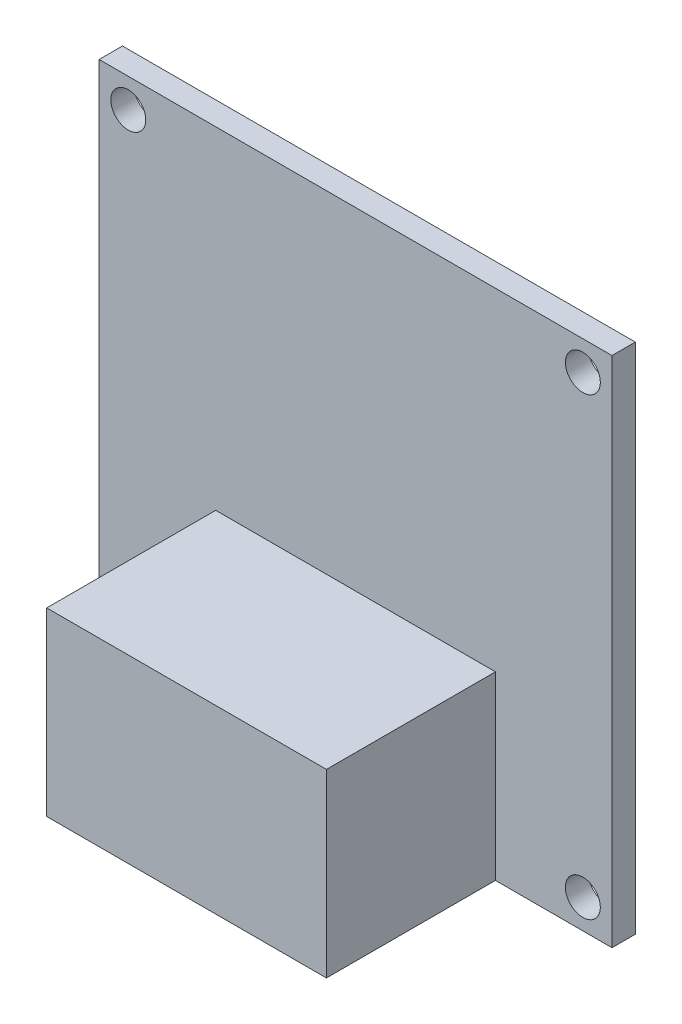
ISO-10303-21;
HEADER;
FILE_DESCRIPTION(('STEP AP214'),'2;1');
FILE_NAME('part.step','',(''),(''),'','','');
FILE_SCHEMA(('AUTOMOTIVE_DESIGN { 1 0 10303 214 1 1 1 1 }'));
ENDSEC;
DATA;
#1=APPLICATION_CONTEXT('core data for automotive mechanical design processes');
#2=APPLICATION_PROTOCOL_DEFINITION('international standard','automotive_design',2000,#1);
#3=PRODUCT_CONTEXT('',#1,'mechanical');
#4=PRODUCT('Part','Part','',(#3));
#5=PRODUCT_RELATED_PRODUCT_CATEGORY('part','',(#4));
#6=PRODUCT_DEFINITION_FORMATION('','',#4);
#7=PRODUCT_DEFINITION_CONTEXT('part definition',#1,'design');
#8=PRODUCT_DEFINITION('design','',#6,#7);
#9=PRODUCT_DEFINITION_SHAPE('','',#8);
#10=(LENGTH_UNIT() NAMED_UNIT(*) SI_UNIT(.MILLI.,.METRE.));
#11=(NAMED_UNIT(*) PLANE_ANGLE_UNIT() SI_UNIT($,.RADIAN.));
#12=(NAMED_UNIT(*) SI_UNIT($,.STERADIAN.) SOLID_ANGLE_UNIT());
#13=UNCERTAINTY_MEASURE_WITH_UNIT(LENGTH_MEASURE(1.E-05),#10,'distance_accuracy_value','');
#14=(GEOMETRIC_REPRESENTATION_CONTEXT(3) GLOBAL_UNCERTAINTY_ASSIGNED_CONTEXT((#13)) GLOBAL_UNIT_ASSIGNED_CONTEXT((#10,
#11,#12)) REPRESENTATION_CONTEXT('',''));
#15=CARTESIAN_POINT('',(0.,0.,0.));
#16=DIRECTION('',(0.,0.,1.));
#17=DIRECTION('',(1.,0.,0.));
#18=AXIS2_PLACEMENT_3D('',#15,#16,#17);
#19=CARTESIAN_POINT('',(12.,-22.,16.5));
#20=DIRECTION('',(0.,1.,0.));
#21=DIRECTION('',(0.,0.,1.));
#22=AXIS2_PLACEMENT_3D('',#19,#20,#21);
#23=PLANE('',#22);
#24=DIRECTION('',(1.,0.,0.));
#25=VECTOR('',#24,1.);
#26=CARTESIAN_POINT('',(12.,-22.,2.));
#27=LINE('',#26,#25);
#28=CARTESIAN_POINT('',(-12.,-22.,2.));
#29=VERTEX_POINT('',#28);
#30=CARTESIAN_POINT('',(12.,-22.,2.));
#31=VERTEX_POINT('',#30);
#32=EDGE_CURVE('E106',#29,#31,#27,.T.);
#33=ORIENTED_EDGE('',*,*,#32,.T.);
#34=DIRECTION('',(0.,0.,-1.));
#35=VECTOR('',#34,1.);
#36=CARTESIAN_POINT('',(12.,-22.,16.5));
#37=LINE('',#36,#35);
#38=CARTESIAN_POINT('',(12.,-22.,16.5));
#39=VERTEX_POINT('',#38);
#40=EDGE_CURVE('E12',#39,#31,#37,.T.);
#41=ORIENTED_EDGE('',*,*,#40,.F.);
#42=DIRECTION('',(1.,0.,0.));
#43=VECTOR('',#42,1.);
#44=CARTESIAN_POINT('',(12.,-22.,16.5));
#45=LINE('',#44,#43);
#46=CARTESIAN_POINT('',(-12.,-22.,16.5));
#47=VERTEX_POINT('',#46);
#48=EDGE_CURVE('E94',#47,#39,#45,.T.);
#49=ORIENTED_EDGE('',*,*,#48,.F.);
#50=DIRECTION('',(0.,0.,-1.));
#51=VECTOR('',#50,1.);
#52=CARTESIAN_POINT('',(-12.,-22.,16.5));
#53=LINE('',#52,#51);
#54=EDGE_CURVE('E102',#47,#29,#53,.T.);
#55=ORIENTED_EDGE('',*,*,#54,.T.);
#56=EDGE_LOOP('',(#33,#41,#49,#55));
#57=FACE_BOUND('',#56,.T.);
#58=ADVANCED_FACE('F43',(#57),#23,.F.);
#59=CARTESIAN_POINT('',(12.,-22.,16.5));
#60=DIRECTION('',(-1.,0.,0.));
#61=DIRECTION('',(0.,-1.,0.));
#62=AXIS2_PLACEMENT_3D('',#59,#60,#61);
#63=PLANE('',#62);
#64=DIRECTION('',(0.,1.,0.));
#65=VECTOR('',#64,1.);
#66=CARTESIAN_POINT('',(12.,-22.,2.));
#67=LINE('',#66,#65);
#68=CARTESIAN_POINT('',(12.,-6.50000000000001,2.));
#69=VERTEX_POINT('',#68);
#70=EDGE_CURVE('E98',#31,#69,#67,.T.);
#71=ORIENTED_EDGE('',*,*,#70,.T.);
#72=DIRECTION('',(0.,0.,-1.));
#73=VECTOR('',#72,1.);
#74=CARTESIAN_POINT('',(12.,-6.50000000000001,16.5));
#75=LINE('',#74,#73);
#76=CARTESIAN_POINT('',(12.,-6.50000000000001,16.5));
#77=VERTEX_POINT('',#76);
#78=EDGE_CURVE('E51',#77,#69,#75,.T.);
#79=ORIENTED_EDGE('',*,*,#78,.F.);
#80=DIRECTION('',(0.,1.,0.));
#81=VECTOR('',#80,1.);
#82=CARTESIAN_POINT('',(12.,-22.,16.5));
#83=LINE('',#82,#81);
#84=EDGE_CURVE('E89',#39,#77,#83,.T.);
#85=ORIENTED_EDGE('',*,*,#84,.F.);
#86=ORIENTED_EDGE('',*,*,#40,.T.);
#87=EDGE_LOOP('',(#71,#79,#85,#86));
#88=FACE_BOUND('',#87,.T.);
#89=ADVANCED_FACE('F97',(#88),#63,.F.);
#90=CARTESIAN_POINT('',(12.,-6.50000000000001,16.5));
#91=DIRECTION('',(0.,-1.,0.));
#92=DIRECTION('',(1.,0.,0.));
#93=AXIS2_PLACEMENT_3D('',#90,#91,#92);
#94=PLANE('',#93);
#95=DIRECTION('',(-1.,0.,0.));
#96=VECTOR('',#95,1.);
#97=CARTESIAN_POINT('',(12.,-6.50000000000001,2.));
#98=LINE('',#97,#96);
#99=CARTESIAN_POINT('',(-12.,-6.50000000000001,2.));
#100=VERTEX_POINT('',#99);
#101=EDGE_CURVE('E76',#69,#100,#98,.T.);
#102=ORIENTED_EDGE('',*,*,#101,.T.);
#103=DIRECTION('',(0.,0.,-1.));
#104=VECTOR('',#103,1.);
#105=CARTESIAN_POINT('',(-12.,-6.50000000000001,16.5));
#106=LINE('',#105,#104);
#107=CARTESIAN_POINT('',(-12.,-6.50000000000001,16.5));
#108=VERTEX_POINT('',#107);
#109=EDGE_CURVE('E99',#108,#100,#106,.T.);
#110=ORIENTED_EDGE('',*,*,#109,.F.);
#111=DIRECTION('',(-1.,0.,0.));
#112=VECTOR('',#111,1.);
#113=CARTESIAN_POINT('',(12.,-6.50000000000001,16.5));
#114=LINE('',#113,#112);
#115=EDGE_CURVE('E92',#77,#108,#114,.T.);
#116=ORIENTED_EDGE('',*,*,#115,.F.);
#117=ORIENTED_EDGE('',*,*,#78,.T.);
#118=EDGE_LOOP('',(#102,#110,#116,#117));
#119=FACE_BOUND('',#118,.T.);
#120=ADVANCED_FACE('F100',(#119),#94,.F.);
#121=CARTESIAN_POINT('',(-12.,-6.50000000000001,16.5));
#122=DIRECTION('',(1.,0.,0.));
#123=DIRECTION('',(0.,1.,0.));
#124=AXIS2_PLACEMENT_3D('',#121,#122,#123);
#125=PLANE('',#124);
#126=DIRECTION('',(0.,-1.,0.));
#127=VECTOR('',#126,1.);
#128=CARTESIAN_POINT('',(-12.,-6.50000000000001,2.));
#129=LINE('',#128,#127);
#130=EDGE_CURVE('E82',#100,#29,#129,.T.);
#131=ORIENTED_EDGE('',*,*,#130,.T.);
#132=ORIENTED_EDGE('',*,*,#54,.F.);
#133=DIRECTION('',(0.,-1.,0.));
#134=VECTOR('',#133,1.);
#135=CARTESIAN_POINT('',(-12.,-6.50000000000001,16.5));
#136=LINE('',#135,#134);
#137=EDGE_CURVE('E59',#108,#47,#136,.T.);
#138=ORIENTED_EDGE('',*,*,#137,.F.);
#139=ORIENTED_EDGE('',*,*,#109,.T.);
#140=EDGE_LOOP('',(#131,#132,#138,#139));
#141=FACE_BOUND('',#140,.T.);
#142=ADVANCED_FACE('F113',(#141),#125,.F.);
#143=CARTESIAN_POINT('',(0.,0.,16.5));
#144=DIRECTION('',(0.,0.,1.));
#145=DIRECTION('',(1.,0.,0.));
#146=AXIS2_PLACEMENT_3D('',#143,#144,#145);
#147=PLANE('',#146);
#148=ORIENTED_EDGE('',*,*,#48,.T.);
#149=ORIENTED_EDGE('',*,*,#84,.T.);
#150=ORIENTED_EDGE('',*,*,#115,.T.);
#151=ORIENTED_EDGE('',*,*,#137,.T.);
#152=EDGE_LOOP('',(#148,#149,#150,#151));
#153=FACE_BOUND('',#152,.T.);
#154=ADVANCED_FACE('F90',(#153),#147,.T.);
#155=CARTESIAN_POINT('',(0.,0.,2.));
#156=DIRECTION('',(0.,0.,1.));
#157=DIRECTION('',(1.,0.,0.));
#158=AXIS2_PLACEMENT_3D('',#155,#156,#157);
#159=PLANE('',#158);
#160=ORIENTED_EDGE('',*,*,#32,.F.);
#161=ORIENTED_EDGE('',*,*,#130,.F.);
#162=ORIENTED_EDGE('',*,*,#101,.F.);
#163=ORIENTED_EDGE('',*,*,#70,.F.);
#164=EDGE_LOOP('',(#160,#161,#162,#163));
#165=FACE_BOUND('',#164,.T.);
#166=ADVANCED_FACE('F116',(#165),#159,.F.);
#167=CLOSED_SHELL('',(#58,#89,#120,#142,#154,#166));
#168=MANIFOLD_SOLID_BREP('B2',#167);
#169=CARTESIAN_POINT('',(0.,0.,2.));
#170=DIRECTION('',(0.,0.,1.));
#171=DIRECTION('',(1.,0.,0.));
#172=AXIS2_PLACEMENT_3D('',#169,#170,#171);
#173=PLANE('',#172);
#174=CARTESIAN_POINT('',(-19.5,-19.5,2.));
#175=DIRECTION('',(0.,0.,1.));
#176=DIRECTION('',(-1.,0.,0.));
#177=AXIS2_PLACEMENT_3D('',#174,#175,#176);
#178=CIRCLE('',#177,1.5);
#179=CARTESIAN_POINT('',(-21.,-19.5,2.));
#180=VERTEX_POINT('',#179);
#181=EDGE_CURVE('E255',#180,#180,#178,.T.);
#182=ORIENTED_EDGE('',*,*,#181,.F.);
#183=EDGE_LOOP('',(#182));
#184=FACE_BOUND('',#183,.T.);
#185=CARTESIAN_POINT('',(19.5,19.5,2.));
#186=DIRECTION('',(0.,0.,1.));
#187=DIRECTION('',(1.,0.,0.));
#188=AXIS2_PLACEMENT_3D('',#185,#186,#187);
#189=CIRCLE('',#188,1.5);
#190=CARTESIAN_POINT('',(21.,19.5,2.));
#191=VERTEX_POINT('',#190);
#192=EDGE_CURVE('E234',#191,#191,#189,.T.);
#193=ORIENTED_EDGE('',*,*,#192,.F.);
#194=EDGE_LOOP('',(#193));
#195=FACE_BOUND('',#194,.T.);
#196=DIRECTION('',(0.,-1.,0.));
#197=VECTOR('',#196,1.);
#198=CARTESIAN_POINT('',(-22.,-22.,2.));
#199=LINE('',#198,#197);
#200=CARTESIAN_POINT('',(-22.,22.,2.));
#201=VERTEX_POINT('',#200);
#202=CARTESIAN_POINT('',(-22.,-22.,2.));
#203=VERTEX_POINT('',#202);
#204=EDGE_CURVE('E219',#201,#203,#199,.T.);
#205=ORIENTED_EDGE('',*,*,#204,.T.);
#206=DIRECTION('',(1.,0.,0.));
#207=VECTOR('',#206,1.);
#208=CARTESIAN_POINT('',(22.,-22.,2.));
#209=LINE('',#208,#207);
#210=CARTESIAN_POINT('',(22.,-22.,2.));
#211=VERTEX_POINT('',#210);
#212=EDGE_CURVE('E214',#203,#211,#209,.T.);
#213=ORIENTED_EDGE('',*,*,#212,.T.);
#214=DIRECTION('',(0.,1.,0.));
#215=VECTOR('',#214,1.);
#216=CARTESIAN_POINT('',(22.,-22.,2.));
#217=LINE('',#216,#215);
#218=CARTESIAN_POINT('',(22.,22.,2.));
#219=VERTEX_POINT('',#218);
#220=EDGE_CURVE('E217',#211,#219,#217,.T.);
#221=ORIENTED_EDGE('',*,*,#220,.T.);
#222=DIRECTION('',(-1.,0.,0.));
#223=VECTOR('',#222,1.);
#224=CARTESIAN_POINT('',(22.,22.,2.));
#225=LINE('',#224,#223);
#226=EDGE_CURVE('E184',#219,#201,#225,.T.);
#227=ORIENTED_EDGE('',*,*,#226,.T.);
#228=EDGE_LOOP('',(#205,#213,#221,#227));
#229=FACE_BOUND('',#228,.T.);
#230=CARTESIAN_POINT('',(19.5,-19.5,2.));
#231=DIRECTION('',(0.,0.,1.));
#232=DIRECTION('',(1.,0.,0.));
#233=AXIS2_PLACEMENT_3D('',#230,#231,#232);
#234=CIRCLE('',#233,1.5);
#235=CARTESIAN_POINT('',(21.,-19.5,2.));
#236=VERTEX_POINT('',#235);
#237=EDGE_CURVE('E249',#236,#236,#234,.T.);
#238=ORIENTED_EDGE('',*,*,#237,.F.);
#239=EDGE_LOOP('',(#238));
#240=FACE_BOUND('',#239,.T.);
#241=CARTESIAN_POINT('',(-19.5,19.5,2.));
#242=DIRECTION('',(0.,0.,1.));
#243=DIRECTION('',(-1.,0.,0.));
#244=AXIS2_PLACEMENT_3D('',#241,#242,#243);
#245=CIRCLE('',#244,1.5);
#246=CARTESIAN_POINT('',(-21.,19.5,2.));
#247=VERTEX_POINT('',#246);
#248=EDGE_CURVE('E261',#247,#247,#245,.T.);
#249=ORIENTED_EDGE('',*,*,#248,.F.);
#250=EDGE_LOOP('',(#249));
#251=FACE_BOUND('',#250,.T.);
#252=ADVANCED_FACE('F167',(#184,#195,#229,#240,#251),#173,.T.);
#253=CARTESIAN_POINT('',(0.,0.,0.));
#254=DIRECTION('',(0.,0.,1.));
#255=DIRECTION('',(1.,0.,0.));
#256=AXIS2_PLACEMENT_3D('',#253,#254,#255);
#257=PLANE('',#256);
#258=DIRECTION('',(0.,-1.,0.));
#259=VECTOR('',#258,1.);
#260=CARTESIAN_POINT('',(-22.,-22.,0.));
#261=LINE('',#260,#259);
#262=CARTESIAN_POINT('',(-22.,22.,0.));
#263=VERTEX_POINT('',#262);
#264=CARTESIAN_POINT('',(-22.,-22.,0.));
#265=VERTEX_POINT('',#264);
#266=EDGE_CURVE('E231',#263,#265,#261,.T.);
#267=ORIENTED_EDGE('',*,*,#266,.F.);
#268=DIRECTION('',(-1.,0.,0.));
#269=VECTOR('',#268,1.);
#270=CARTESIAN_POINT('',(22.,22.,0.));
#271=LINE('',#270,#269);
#272=CARTESIAN_POINT('',(22.,22.,0.));
#273=VERTEX_POINT('',#272);
#274=EDGE_CURVE('E207',#273,#263,#271,.T.);
#275=ORIENTED_EDGE('',*,*,#274,.F.);
#276=DIRECTION('',(0.,1.,0.));
#277=VECTOR('',#276,1.);
#278=CARTESIAN_POINT('',(22.,-22.,0.));
#279=LINE('',#278,#277);
#280=CARTESIAN_POINT('',(22.,-22.,0.));
#281=VERTEX_POINT('',#280);
#282=EDGE_CURVE('E201',#281,#273,#279,.T.);
#283=ORIENTED_EDGE('',*,*,#282,.F.);
#284=DIRECTION('',(1.,0.,0.));
#285=VECTOR('',#284,1.);
#286=CARTESIAN_POINT('',(22.,-22.,0.));
#287=LINE('',#286,#285);
#288=EDGE_CURVE('E223',#265,#281,#287,.T.);
#289=ORIENTED_EDGE('',*,*,#288,.F.);
#290=EDGE_LOOP('',(#267,#275,#283,#289));
#291=FACE_BOUND('',#290,.T.);
#292=CARTESIAN_POINT('',(19.5,19.5,0.));
#293=DIRECTION('',(0.,0.,1.));
#294=DIRECTION('',(1.,0.,0.));
#295=AXIS2_PLACEMENT_3D('',#292,#293,#294);
#296=CIRCLE('',#295,1.5);
#297=CARTESIAN_POINT('',(21.,19.5,0.));
#298=VERTEX_POINT('',#297);
#299=EDGE_CURVE('E246',#298,#298,#296,.T.);
#300=ORIENTED_EDGE('',*,*,#299,.T.);
#301=EDGE_LOOP('',(#300));
#302=FACE_BOUND('',#301,.T.);
#303=CARTESIAN_POINT('',(19.5,-19.5,0.));
#304=DIRECTION('',(0.,0.,1.));
#305=DIRECTION('',(1.,0.,0.));
#306=AXIS2_PLACEMENT_3D('',#303,#304,#305);
#307=CIRCLE('',#306,1.5);
#308=CARTESIAN_POINT('',(21.,-19.5,0.));
#309=VERTEX_POINT('',#308);
#310=EDGE_CURVE('E252',#309,#309,#307,.T.);
#311=ORIENTED_EDGE('',*,*,#310,.T.);
#312=EDGE_LOOP('',(#311));
#313=FACE_BOUND('',#312,.T.);
#314=CARTESIAN_POINT('',(-19.5,-19.5,0.));
#315=DIRECTION('',(0.,0.,1.));
#316=DIRECTION('',(-1.,0.,0.));
#317=AXIS2_PLACEMENT_3D('',#314,#315,#316);
#318=CIRCLE('',#317,1.5);
#319=CARTESIAN_POINT('',(-21.,-19.5,0.));
#320=VERTEX_POINT('',#319);
#321=EDGE_CURVE('E258',#320,#320,#318,.T.);
#322=ORIENTED_EDGE('',*,*,#321,.T.);
#323=EDGE_LOOP('',(#322));
#324=FACE_BOUND('',#323,.T.);
#325=CARTESIAN_POINT('',(-19.5,19.5,0.));
#326=DIRECTION('',(0.,0.,1.));
#327=DIRECTION('',(-1.,0.,0.));
#328=AXIS2_PLACEMENT_3D('',#325,#326,#327);
#329=CIRCLE('',#328,1.5);
#330=CARTESIAN_POINT('',(-21.,19.5,0.));
#331=VERTEX_POINT('',#330);
#332=EDGE_CURVE('E264',#331,#331,#329,.T.);
#333=ORIENTED_EDGE('',*,*,#332,.T.);
#334=EDGE_LOOP('',(#333));
#335=FACE_BOUND('',#334,.T.);
#336=ADVANCED_FACE('F242',(#291,#302,#313,#324,#335),#257,.F.);
#337=CARTESIAN_POINT('',(-22.,-22.,2.));
#338=DIRECTION('',(1.,0.,0.));
#339=DIRECTION('',(0.,0.,-1.));
#340=AXIS2_PLACEMENT_3D('',#337,#338,#339);
#341=PLANE('',#340);
#342=ORIENTED_EDGE('',*,*,#266,.T.);
#343=DIRECTION('',(0.,0.,-1.));
#344=VECTOR('',#343,1.);
#345=CARTESIAN_POINT('',(-22.,-22.,2.));
#346=LINE('',#345,#344);
#347=EDGE_CURVE('E41',#203,#265,#346,.T.);
#348=ORIENTED_EDGE('',*,*,#347,.F.);
#349=ORIENTED_EDGE('',*,*,#204,.F.);
#350=DIRECTION('',(0.,0.,-1.));
#351=VECTOR('',#350,1.);
#352=CARTESIAN_POINT('',(-22.,22.,2.));
#353=LINE('',#352,#351);
#354=EDGE_CURVE('E227',#201,#263,#353,.T.);
#355=ORIENTED_EDGE('',*,*,#354,.T.);
#356=EDGE_LOOP('',(#342,#348,#349,#355));
#357=FACE_BOUND('',#356,.T.);
#358=ADVANCED_FACE('F169',(#357),#341,.F.);
#359=CARTESIAN_POINT('',(22.,-22.,2.));
#360=DIRECTION('',(0.,1.,0.));
#361=DIRECTION('',(-1.,0.,0.));
#362=AXIS2_PLACEMENT_3D('',#359,#360,#361);
#363=PLANE('',#362);
#364=ORIENTED_EDGE('',*,*,#288,.T.);
#365=DIRECTION('',(0.,0.,-1.));
#366=VECTOR('',#365,1.);
#367=CARTESIAN_POINT('',(22.,-22.,2.));
#368=LINE('',#367,#366);
#369=EDGE_CURVE('E176',#211,#281,#368,.T.);
#370=ORIENTED_EDGE('',*,*,#369,.F.);
#371=ORIENTED_EDGE('',*,*,#212,.F.);
#372=ORIENTED_EDGE('',*,*,#347,.T.);
#373=EDGE_LOOP('',(#364,#370,#371,#372));
#374=FACE_BOUND('',#373,.T.);
#375=ADVANCED_FACE('F222',(#374),#363,.F.);
#376=CARTESIAN_POINT('',(22.,-22.,2.));
#377=DIRECTION('',(-1.,0.,0.));
#378=DIRECTION('',(0.,0.,1.));
#379=AXIS2_PLACEMENT_3D('',#376,#377,#378);
#380=PLANE('',#379);
#381=ORIENTED_EDGE('',*,*,#282,.T.);
#382=DIRECTION('',(0.,0.,-1.));
#383=VECTOR('',#382,1.);
#384=CARTESIAN_POINT('',(22.,22.,2.));
#385=LINE('',#384,#383);
#386=EDGE_CURVE('E224',#219,#273,#385,.T.);
#387=ORIENTED_EDGE('',*,*,#386,.F.);
#388=ORIENTED_EDGE('',*,*,#220,.F.);
#389=ORIENTED_EDGE('',*,*,#369,.T.);
#390=EDGE_LOOP('',(#381,#387,#388,#389));
#391=FACE_BOUND('',#390,.T.);
#392=ADVANCED_FACE('F225',(#391),#380,.F.);
#393=CARTESIAN_POINT('',(22.,22.,2.));
#394=DIRECTION('',(0.,-1.,0.));
#395=DIRECTION('',(1.,0.,0.));
#396=AXIS2_PLACEMENT_3D('',#393,#394,#395);
#397=PLANE('',#396);
#398=ORIENTED_EDGE('',*,*,#274,.T.);
#399=ORIENTED_EDGE('',*,*,#354,.F.);
#400=ORIENTED_EDGE('',*,*,#226,.F.);
#401=ORIENTED_EDGE('',*,*,#386,.T.);
#402=EDGE_LOOP('',(#398,#399,#400,#401));
#403=FACE_BOUND('',#402,.T.);
#404=ADVANCED_FACE('F239',(#403),#397,.F.);
#405=CARTESIAN_POINT('',(19.5,19.5,2.));
#406=DIRECTION('',(0.,0.,-1.));
#407=DIRECTION('',(-1.,0.,0.));
#408=AXIS2_PLACEMENT_3D('',#405,#406,#407);
#409=CYLINDRICAL_SURFACE('',#408,1.5);
#410=ORIENTED_EDGE('',*,*,#192,.T.);
#411=EDGE_LOOP('',(#410));
#412=FACE_BOUND('',#411,.T.);
#413=ORIENTED_EDGE('',*,*,#299,.F.);
#414=EDGE_LOOP('',(#413));
#415=FACE_BOUND('',#414,.T.);
#416=ADVANCED_FACE('F283',(#412,#415),#409,.F.);
#417=CARTESIAN_POINT('',(19.5,-19.5,2.));
#418=DIRECTION('',(0.,0.,-1.));
#419=DIRECTION('',(-1.,0.,0.));
#420=AXIS2_PLACEMENT_3D('',#417,#418,#419);
#421=CYLINDRICAL_SURFACE('',#420,1.5);
#422=ORIENTED_EDGE('',*,*,#237,.T.);
#423=EDGE_LOOP('',(#422));
#424=FACE_BOUND('',#423,.T.);
#425=ORIENTED_EDGE('',*,*,#310,.F.);
#426=EDGE_LOOP('',(#425));
#427=FACE_BOUND('',#426,.T.);
#428=ADVANCED_FACE('F329',(#424,#427),#421,.F.);
#429=CARTESIAN_POINT('',(-19.5,-19.5,2.));
#430=DIRECTION('',(0.,0.,-1.));
#431=DIRECTION('',(-1.,0.,0.));
#432=AXIS2_PLACEMENT_3D('',#429,#430,#431);
#433=CYLINDRICAL_SURFACE('',#432,1.5);
#434=ORIENTED_EDGE('',*,*,#181,.T.);
#435=EDGE_LOOP('',(#434));
#436=FACE_BOUND('',#435,.T.);
#437=ORIENTED_EDGE('',*,*,#321,.F.);
#438=EDGE_LOOP('',(#437));
#439=FACE_BOUND('',#438,.T.);
#440=ADVANCED_FACE('F337',(#436,#439),#433,.F.);
#441=CARTESIAN_POINT('',(-19.5,19.5,2.));
#442=DIRECTION('',(0.,0.,-1.));
#443=DIRECTION('',(-1.,0.,0.));
#444=AXIS2_PLACEMENT_3D('',#441,#442,#443);
#445=CYLINDRICAL_SURFACE('',#444,1.5);
#446=ORIENTED_EDGE('',*,*,#248,.T.);
#447=EDGE_LOOP('',(#446));
#448=FACE_BOUND('',#447,.T.);
#449=ORIENTED_EDGE('',*,*,#332,.F.);
#450=EDGE_LOOP('',(#449));
#451=FACE_BOUND('',#450,.T.);
#452=ADVANCED_FACE('F270',(#448,#451),#445,.F.);
#453=CLOSED_SHELL('',(#252,#336,#358,#375,#392,#404,#416,#428,#440,#452));
#454=MANIFOLD_SOLID_BREP('B6',#453);
#455=ADVANCED_BREP_SHAPE_REPRESENTATION('',(#18,#168,#454),#14);
#456=SHAPE_DEFINITION_REPRESENTATION(#9,#455);
ENDSEC;
END-ISO-10303-21;
